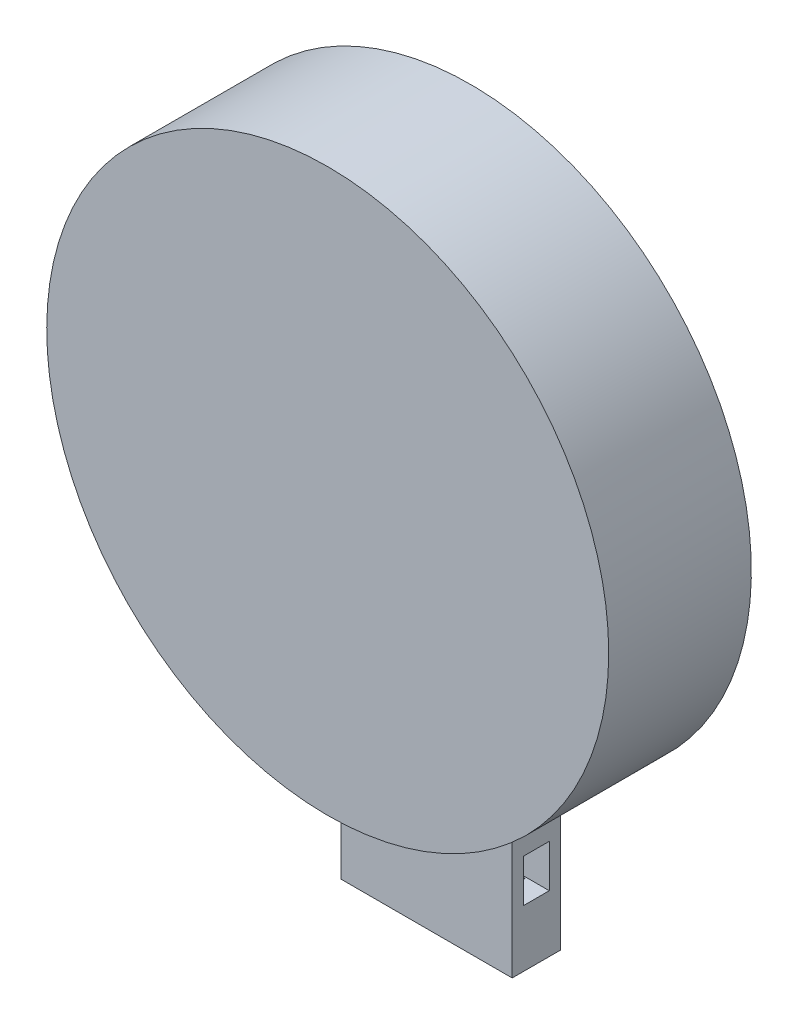
ISO-10303-21;
HEADER;
FILE_DESCRIPTION(('STEP AP214'),'2;1');
FILE_NAME('part.step','',(''),(''),'','','');
FILE_SCHEMA(('AUTOMOTIVE_DESIGN { 1 0 10303 214 1 1 1 1 }'));
ENDSEC;
DATA;
#1=APPLICATION_CONTEXT('core data for automotive mechanical design processes');
#2=APPLICATION_PROTOCOL_DEFINITION('international standard','automotive_design',2000,#1);
#3=PRODUCT_CONTEXT('',#1,'mechanical');
#4=PRODUCT('Part','Part','',(#3));
#5=PRODUCT_RELATED_PRODUCT_CATEGORY('part','',(#4));
#6=PRODUCT_DEFINITION_FORMATION('','',#4);
#7=PRODUCT_DEFINITION_CONTEXT('part definition',#1,'design');
#8=PRODUCT_DEFINITION('design','',#6,#7);
#9=PRODUCT_DEFINITION_SHAPE('','',#8);
#10=(LENGTH_UNIT() NAMED_UNIT(*) SI_UNIT(.MILLI.,.METRE.));
#11=(NAMED_UNIT(*) PLANE_ANGLE_UNIT() SI_UNIT($,.RADIAN.));
#12=(NAMED_UNIT(*) SI_UNIT($,.STERADIAN.) SOLID_ANGLE_UNIT());
#13=UNCERTAINTY_MEASURE_WITH_UNIT(LENGTH_MEASURE(1.E-05),#10,'distance_accuracy_value','');
#14=(GEOMETRIC_REPRESENTATION_CONTEXT(3) GLOBAL_UNCERTAINTY_ASSIGNED_CONTEXT((#13)) GLOBAL_UNIT_ASSIGNED_CONTEXT((#10,
#11,#12)) REPRESENTATION_CONTEXT('',''));
#15=CARTESIAN_POINT('',(0.,0.,0.));
#16=DIRECTION('',(0.,0.,1.));
#17=DIRECTION('',(1.,0.,0.));
#18=AXIS2_PLACEMENT_3D('',#15,#16,#17);
#19=CARTESIAN_POINT('',(0.,0.,50.));
#20=DIRECTION('',(0.,0.,-1.));
#21=DIRECTION('',(-1.,0.,0.));
#22=AXIS2_PLACEMENT_3D('',#19,#20,#21);
#23=CYLINDRICAL_SURFACE('',#22,98.5054101986852);
#24=CARTESIAN_POINT('',(0.,0.,50.));
#25=DIRECTION('',(0.,0.,1.));
#26=DIRECTION('',(1.,0.,0.));
#27=AXIS2_PLACEMENT_3D('',#24,#25,#26);
#28=CIRCLE('',#27,98.5054101986852);
#29=CARTESIAN_POINT('',(98.5054101986852,0.,50.));
#30=VERTEX_POINT('',#29);
#31=EDGE_CURVE('E311',#30,#30,#28,.T.);
#32=ORIENTED_EDGE('',*,*,#31,.F.);
#33=EDGE_LOOP('',(#32));
#34=FACE_BOUND('',#33,.T.);
#35=DIRECTION('',(0.,0.,-1.));
#36=VECTOR('',#35,1.);
#37=CARTESIAN_POINT('',(-28.3340349649579,-94.3424522737021,50.));
#38=LINE('',#37,#36);
#39=CARTESIAN_POINT('',(-28.3340349649579,-94.3424522737022,17.));
#40=VERTEX_POINT('',#39);
#41=CARTESIAN_POINT('',(-28.3340349649579,-94.3424522737022,0.));
#42=VERTEX_POINT('',#41);
#43=EDGE_CURVE('E254',#40,#42,#38,.T.);
#44=ORIENTED_EDGE('',*,*,#43,.F.);
#45=CARTESIAN_POINT('',(0.,0.,17.));
#46=DIRECTION('',(0.,0.,1.));
#47=DIRECTION('',(1.,0.,0.));
#48=AXIS2_PLACEMENT_3D('',#45,#46,#47);
#49=CIRCLE('',#48,98.5054101986852);
#50=CARTESIAN_POINT('',(31.6659650350421,-93.2769129892854,17.));
#51=VERTEX_POINT('',#50);
#52=EDGE_CURVE('E274',#51,#40,#49,.F.);
#53=ORIENTED_EDGE('',*,*,#52,.F.);
#54=DIRECTION('',(0.,0.,-1.));
#55=VECTOR('',#54,1.);
#56=CARTESIAN_POINT('',(31.6659650350421,-93.2769129892854,50.));
#57=LINE('',#56,#55);
#58=CARTESIAN_POINT('',(31.6659650350421,-93.2769129892854,0.));
#59=VERTEX_POINT('',#58);
#60=EDGE_CURVE('E273',#59,#51,#57,.F.);
#61=ORIENTED_EDGE('',*,*,#60,.F.);
#62=CARTESIAN_POINT('',(0.,0.,0.));
#63=DIRECTION('',(0.,0.,1.));
#64=DIRECTION('',(1.,0.,0.));
#65=AXIS2_PLACEMENT_3D('',#62,#63,#64);
#66=CIRCLE('',#65,98.5054101986852);
#67=EDGE_CURVE('E310',#59,#42,#66,.T.);
#68=ORIENTED_EDGE('',*,*,#67,.T.);
#69=EDGE_LOOP('',(#44,#53,#61,#68));
#70=FACE_BOUND('',#69,.T.);
#71=ADVANCED_FACE('F39',(#34,#70),#23,.T.);
#72=CARTESIAN_POINT('',(0.,0.,50.));
#73=DIRECTION('',(0.,0.,1.));
#74=DIRECTION('',(1.,0.,0.));
#75=AXIS2_PLACEMENT_3D('',#72,#73,#74);
#76=PLANE('',#75);
#77=ORIENTED_EDGE('',*,*,#31,.T.);
#78=EDGE_LOOP('',(#77));
#79=FACE_BOUND('',#78,.T.);
#80=ADVANCED_FACE('F345',(#79),#76,.T.);
#81=CARTESIAN_POINT('',(0.,0.,0.));
#82=DIRECTION('',(0.,0.,1.));
#83=DIRECTION('',(1.,0.,0.));
#84=AXIS2_PLACEMENT_3D('',#81,#82,#83);
#85=PLANE('',#84);
#86=ORIENTED_EDGE('',*,*,#67,.F.);
#87=DIRECTION('',(0.,1.,0.));
#88=VECTOR('',#87,1.);
#89=CARTESIAN_POINT('',(31.6659650350421,-148.505410198685,0.));
#90=LINE('',#89,#88);
#91=CARTESIAN_POINT('',(31.6659650350421,-148.505410198685,0.));
#92=VERTEX_POINT('',#91);
#93=EDGE_CURVE('E302',#92,#59,#90,.T.);
#94=ORIENTED_EDGE('',*,*,#93,.F.);
#95=DIRECTION('',(1.,0.,0.));
#96=VECTOR('',#95,1.);
#97=CARTESIAN_POINT('',(31.6659650350421,-148.505410198685,0.));
#98=LINE('',#97,#96);
#99=CARTESIAN_POINT('',(-28.3340349649579,-148.505410198685,0.));
#100=VERTEX_POINT('',#99);
#101=EDGE_CURVE('E285',#100,#92,#98,.T.);
#102=ORIENTED_EDGE('',*,*,#101,.F.);
#103=DIRECTION('',(0.,1.,0.));
#104=VECTOR('',#103,1.);
#105=CARTESIAN_POINT('',(-28.3340349649579,-148.505410198685,0.));
#106=LINE('',#105,#104);
#107=EDGE_CURVE('E306',#100,#42,#106,.T.);
#108=ORIENTED_EDGE('',*,*,#107,.T.);
#109=EDGE_LOOP('',(#86,#94,#102,#108));
#110=FACE_BOUND('',#109,.T.);
#111=ADVANCED_FACE('F350',(#110),#85,.F.);
#112=CARTESIAN_POINT('',(-28.3340349649579,-148.505410198685,17.));
#113=DIRECTION('',(1.,0.,0.));
#114=DIRECTION('',(0.,0.,-1.));
#115=AXIS2_PLACEMENT_3D('',#112,#113,#114);
#116=PLANE('',#115);
#117=DIRECTION('',(0.,0.,1.));
#118=VECTOR('',#117,1.);
#119=CARTESIAN_POINT('',(-28.3340349649579,-128.505410198685,4.));
#120=LINE('',#119,#118);
#121=CARTESIAN_POINT('',(-28.3340349649579,-128.505410198685,4.));
#122=VERTEX_POINT('',#121);
#123=CARTESIAN_POINT('',(-28.3340349649579,-128.505410198685,13.));
#124=VERTEX_POINT('',#123);
#125=EDGE_CURVE('E164',#122,#124,#120,.T.);
#126=ORIENTED_EDGE('',*,*,#125,.F.);
#127=DIRECTION('',(0.,-1.,0.));
#128=VECTOR('',#127,1.);
#129=CARTESIAN_POINT('',(-28.3340349649579,-113.505410198685,4.));
#130=LINE('',#129,#128);
#131=CARTESIAN_POINT('',(-28.3340349649579,-113.505410198685,4.));
#132=VERTEX_POINT('',#131);
#133=EDGE_CURVE('E54',#132,#122,#130,.T.);
#134=ORIENTED_EDGE('',*,*,#133,.F.);
#135=DIRECTION('',(0.,0.,-1.));
#136=VECTOR('',#135,1.);
#137=CARTESIAN_POINT('',(-28.3340349649579,-113.505410198685,4.));
#138=LINE('',#137,#136);
#139=CARTESIAN_POINT('',(-28.3340349649579,-113.505410198685,13.));
#140=VERTEX_POINT('',#139);
#141=EDGE_CURVE('E172',#140,#132,#138,.T.);
#142=ORIENTED_EDGE('',*,*,#141,.F.);
#143=DIRECTION('',(0.,1.,0.));
#144=VECTOR('',#143,1.);
#145=CARTESIAN_POINT('',(-28.3340349649579,-113.505410198685,13.));
#146=LINE('',#145,#144);
#147=EDGE_CURVE('E155',#124,#140,#146,.T.);
#148=ORIENTED_EDGE('',*,*,#147,.F.);
#149=EDGE_LOOP('',(#126,#134,#142,#148));
#150=FACE_BOUND('',#149,.T.);
#151=DIRECTION('',(0.,1.,0.));
#152=VECTOR('',#151,1.);
#153=CARTESIAN_POINT('',(-28.3340349649579,-148.505410198685,17.));
#154=LINE('',#153,#152);
#155=CARTESIAN_POINT('',(-28.3340349649579,-148.505410198685,17.));
#156=VERTEX_POINT('',#155);
#157=EDGE_CURVE('E294',#156,#40,#154,.T.);
#158=ORIENTED_EDGE('',*,*,#157,.T.);
#159=ORIENTED_EDGE('',*,*,#43,.T.);
#160=ORIENTED_EDGE('',*,*,#107,.F.);
#161=DIRECTION('',(0.,0.,-1.));
#162=VECTOR('',#161,1.);
#163=CARTESIAN_POINT('',(-28.3340349649579,-148.505410198685,17.));
#164=LINE('',#163,#162);
#165=EDGE_CURVE('E278',#156,#100,#164,.T.);
#166=ORIENTED_EDGE('',*,*,#165,.F.);
#167=EDGE_LOOP('',(#158,#159,#160,#166));
#168=FACE_BOUND('',#167,.T.);
#169=ADVANCED_FACE('F169',(#150,#168),#116,.F.);
#170=CARTESIAN_POINT('',(31.6659650350421,-148.505410198685,17.));
#171=DIRECTION('',(-1.,0.,0.));
#172=DIRECTION('',(0.,0.,1.));
#173=AXIS2_PLACEMENT_3D('',#170,#171,#172);
#174=PLANE('',#173);
#175=DIRECTION('',(0.,0.,-1.));
#176=VECTOR('',#175,1.);
#177=CARTESIAN_POINT('',(31.6659650350421,-113.505410198685,16.9999999999999));
#178=LINE('',#177,#176);
#179=CARTESIAN_POINT('',(31.6659650350421,-113.505410198685,13.));
#180=VERTEX_POINT('',#179);
#181=CARTESIAN_POINT('',(31.6659650350421,-113.505410198685,4.));
#182=VERTEX_POINT('',#181);
#183=EDGE_CURVE('E213',#180,#182,#178,.T.);
#184=ORIENTED_EDGE('',*,*,#183,.T.);
#185=DIRECTION('',(0.,-1.,0.));
#186=VECTOR('',#185,1.);
#187=CARTESIAN_POINT('',(31.6659650350421,-148.505410198685,4.));
#188=LINE('',#187,#186);
#189=CARTESIAN_POINT('',(31.6659650350421,-128.505410198685,4.));
#190=VERTEX_POINT('',#189);
#191=EDGE_CURVE('E11',#182,#190,#188,.T.);
#192=ORIENTED_EDGE('',*,*,#191,.T.);
#193=DIRECTION('',(0.,0.,1.));
#194=VECTOR('',#193,1.);
#195=CARTESIAN_POINT('',(31.6659650350421,-128.505410198685,17.));
#196=LINE('',#195,#194);
#197=CARTESIAN_POINT('',(31.6659650350421,-128.505410198685,13.));
#198=VERTEX_POINT('',#197);
#199=EDGE_CURVE('E198',#190,#198,#196,.T.);
#200=ORIENTED_EDGE('',*,*,#199,.T.);
#201=DIRECTION('',(0.,1.,0.));
#202=VECTOR('',#201,1.);
#203=CARTESIAN_POINT('',(31.6659650350421,-148.505410198685,13.));
#204=LINE('',#203,#202);
#205=EDGE_CURVE('E47',#198,#180,#204,.T.);
#206=ORIENTED_EDGE('',*,*,#205,.T.);
#207=EDGE_LOOP('',(#184,#192,#200,#206));
#208=FACE_BOUND('',#207,.T.);
#209=ORIENTED_EDGE('',*,*,#93,.T.);
#210=ORIENTED_EDGE('',*,*,#60,.T.);
#211=DIRECTION('',(0.,1.,0.));
#212=VECTOR('',#211,1.);
#213=CARTESIAN_POINT('',(31.6659650350421,-148.505410198685,17.));
#214=LINE('',#213,#212);
#215=CARTESIAN_POINT('',(31.6659650350421,-148.505410198685,17.));
#216=VERTEX_POINT('',#215);
#217=EDGE_CURVE('E298',#216,#51,#214,.T.);
#218=ORIENTED_EDGE('',*,*,#217,.F.);
#219=DIRECTION('',(0.,0.,1.));
#220=VECTOR('',#219,1.);
#221=CARTESIAN_POINT('',(31.6659650350421,-148.505410198685,17.));
#222=LINE('',#221,#220);
#223=EDGE_CURVE('E288',#92,#216,#222,.T.);
#224=ORIENTED_EDGE('',*,*,#223,.F.);
#225=EDGE_LOOP('',(#209,#210,#218,#224));
#226=FACE_BOUND('',#225,.T.);
#227=ADVANCED_FACE('F326',(#208,#226),#174,.F.);
#228=CARTESIAN_POINT('',(31.6659650350421,-148.505410198685,17.));
#229=DIRECTION('',(0.,0.,-1.));
#230=DIRECTION('',(-1.,0.,0.));
#231=AXIS2_PLACEMENT_3D('',#228,#229,#230);
#232=PLANE('',#231);
#233=ORIENTED_EDGE('',*,*,#217,.T.);
#234=ORIENTED_EDGE('',*,*,#52,.T.);
#235=ORIENTED_EDGE('',*,*,#157,.F.);
#236=DIRECTION('',(-1.,0.,0.));
#237=VECTOR('',#236,1.);
#238=CARTESIAN_POINT('',(31.6659650350421,-148.505410198685,17.));
#239=LINE('',#238,#237);
#240=EDGE_CURVE('E291',#216,#156,#239,.T.);
#241=ORIENTED_EDGE('',*,*,#240,.F.);
#242=EDGE_LOOP('',(#233,#234,#235,#241));
#243=FACE_BOUND('',#242,.T.);
#244=ADVANCED_FACE('F361',(#243),#232,.F.);
#245=CARTESIAN_POINT('',(0.,-148.505410198685,0.));
#246=DIRECTION('',(0.,1.,0.));
#247=DIRECTION('',(0.,0.,1.));
#248=AXIS2_PLACEMENT_3D('',#245,#246,#247);
#249=PLANE('',#248);
#250=DIRECTION('',(1.,0.,0.));
#251=VECTOR('',#250,1.);
#252=CARTESIAN_POINT('',(23.6659650350421,-148.505410198685,4.5));
#253=LINE('',#252,#251);
#254=CARTESIAN_POINT('',(-20.3340349649579,-148.505410198685,4.49999999999999));
#255=VERTEX_POINT('',#254);
#256=CARTESIAN_POINT('',(23.6659650350421,-148.505410198685,4.5));
#257=VERTEX_POINT('',#256);
#258=EDGE_CURVE('E239',#255,#257,#253,.T.);
#259=ORIENTED_EDGE('',*,*,#258,.F.);
#260=DIRECTION('',(0.,0.,-1.));
#261=VECTOR('',#260,1.);
#262=CARTESIAN_POINT('',(-20.3340349649579,-148.505410198685,4.49999999999999));
#263=LINE('',#262,#261);
#264=CARTESIAN_POINT('',(-20.3340349649579,-148.505410198685,12.5));
#265=VERTEX_POINT('',#264);
#266=EDGE_CURVE('E217',#265,#255,#263,.T.);
#267=ORIENTED_EDGE('',*,*,#266,.F.);
#268=DIRECTION('',(-1.,0.,0.));
#269=VECTOR('',#268,1.);
#270=CARTESIAN_POINT('',(23.6659650350421,-148.505410198685,12.5));
#271=LINE('',#270,#269);
#272=CARTESIAN_POINT('',(23.6659650350421,-148.505410198685,12.5));
#273=VERTEX_POINT('',#272);
#274=EDGE_CURVE('E223',#273,#265,#271,.T.);
#275=ORIENTED_EDGE('',*,*,#274,.F.);
#276=DIRECTION('',(0.,0.,1.));
#277=VECTOR('',#276,1.);
#278=CARTESIAN_POINT('',(23.6659650350421,-148.505410198685,4.5));
#279=LINE('',#278,#277);
#280=EDGE_CURVE('E243',#257,#273,#279,.T.);
#281=ORIENTED_EDGE('',*,*,#280,.F.);
#282=EDGE_LOOP('',(#259,#267,#275,#281));
#283=FACE_BOUND('',#282,.T.);
#284=ORIENTED_EDGE('',*,*,#165,.T.);
#285=ORIENTED_EDGE('',*,*,#101,.T.);
#286=ORIENTED_EDGE('',*,*,#223,.T.);
#287=ORIENTED_EDGE('',*,*,#240,.T.);
#288=EDGE_LOOP('',(#284,#285,#286,#287));
#289=FACE_BOUND('',#288,.T.);
#290=ADVANCED_FACE('F367',(#283,#289),#249,.F.);
#291=CARTESIAN_POINT('',(-20.3340349649579,-108.505410198685,4.49999999999999));
#292=DIRECTION('',(-1.,0.,0.));
#293=DIRECTION('',(0.,0.,1.));
#294=AXIS2_PLACEMENT_3D('',#291,#292,#293);
#295=PLANE('',#294);
#296=DIRECTION('',(0.,-1.,0.));
#297=VECTOR('',#296,1.);
#298=CARTESIAN_POINT('',(-20.3340349649579,-108.505410198685,4.49999999999999));
#299=LINE('',#298,#297);
#300=CARTESIAN_POINT('',(-20.3340349649579,-128.505410198685,4.49999999999999));
#301=VERTEX_POINT('',#300);
#302=EDGE_CURVE('E235',#301,#255,#299,.T.);
#303=ORIENTED_EDGE('',*,*,#302,.F.);
#304=DIRECTION('',(0.,0.,1.));
#305=VECTOR('',#304,1.);
#306=CARTESIAN_POINT('',(-20.3340349649579,-128.505410198685,4.49999999999999));
#307=LINE('',#306,#305);
#308=CARTESIAN_POINT('',(-20.3340349649579,-128.505410198685,12.5));
#309=VERTEX_POINT('',#308);
#310=EDGE_CURVE('E194',#301,#309,#307,.T.);
#311=ORIENTED_EDGE('',*,*,#310,.T.);
#312=DIRECTION('',(0.,-1.,0.));
#313=VECTOR('',#312,1.);
#314=CARTESIAN_POINT('',(-20.3340349649579,-108.505410198685,12.5));
#315=LINE('',#314,#313);
#316=EDGE_CURVE('E255',#309,#265,#315,.T.);
#317=ORIENTED_EDGE('',*,*,#316,.T.);
#318=ORIENTED_EDGE('',*,*,#266,.T.);
#319=EDGE_LOOP('',(#303,#311,#317,#318));
#320=FACE_BOUND('',#319,.T.);
#321=ADVANCED_FACE('F369',(#320),#295,.F.);
#322=CARTESIAN_POINT('',(23.6659650350421,-108.505410198685,12.5));
#323=DIRECTION('',(0.,0.,1.));
#324=DIRECTION('',(1.,0.,0.));
#325=AXIS2_PLACEMENT_3D('',#322,#323,#324);
#326=PLANE('',#325);
#327=ORIENTED_EDGE('',*,*,#316,.F.);
#328=DIRECTION('',(1.,0.,0.));
#329=VECTOR('',#328,1.);
#330=CARTESIAN_POINT('',(23.6659650350421,-128.505410198685,12.5));
#331=LINE('',#330,#329);
#332=CARTESIAN_POINT('',(23.6659650350421,-128.505410198685,12.5));
#333=VERTEX_POINT('',#332);
#334=EDGE_CURVE('E190',#309,#333,#331,.T.);
#335=ORIENTED_EDGE('',*,*,#334,.T.);
#336=DIRECTION('',(0.,-1.,0.));
#337=VECTOR('',#336,1.);
#338=CARTESIAN_POINT('',(23.6659650350421,-108.505410198685,12.5));
#339=LINE('',#338,#337);
#340=EDGE_CURVE('E260',#333,#273,#339,.T.);
#341=ORIENTED_EDGE('',*,*,#340,.T.);
#342=ORIENTED_EDGE('',*,*,#274,.T.);
#343=EDGE_LOOP('',(#327,#335,#341,#342));
#344=FACE_BOUND('',#343,.T.);
#345=ADVANCED_FACE('F376',(#344),#326,.F.);
#346=CARTESIAN_POINT('',(23.6659650350421,-108.505410198685,4.5));
#347=DIRECTION('',(1.,0.,0.));
#348=DIRECTION('',(0.,0.,-1.));
#349=AXIS2_PLACEMENT_3D('',#346,#347,#348);
#350=PLANE('',#349);
#351=ORIENTED_EDGE('',*,*,#340,.F.);
#352=DIRECTION('',(0.,0.,-1.));
#353=VECTOR('',#352,1.);
#354=CARTESIAN_POINT('',(23.6659650350421,-128.505410198685,4.5));
#355=LINE('',#354,#353);
#356=CARTESIAN_POINT('',(23.6659650350421,-128.505410198685,4.5));
#357=VERTEX_POINT('',#356);
#358=EDGE_CURVE('E182',#333,#357,#355,.T.);
#359=ORIENTED_EDGE('',*,*,#358,.T.);
#360=DIRECTION('',(0.,-1.,0.));
#361=VECTOR('',#360,1.);
#362=CARTESIAN_POINT('',(23.6659650350421,-108.505410198685,4.5));
#363=LINE('',#362,#361);
#364=EDGE_CURVE('E265',#357,#257,#363,.T.);
#365=ORIENTED_EDGE('',*,*,#364,.T.);
#366=ORIENTED_EDGE('',*,*,#280,.T.);
#367=EDGE_LOOP('',(#351,#359,#365,#366));
#368=FACE_BOUND('',#367,.T.);
#369=ADVANCED_FACE('F442',(#368),#350,.F.);
#370=CARTESIAN_POINT('',(23.6659650350421,-108.505410198685,4.5));
#371=DIRECTION('',(0.,0.,-1.));
#372=DIRECTION('',(-1.,0.,0.));
#373=AXIS2_PLACEMENT_3D('',#370,#371,#372);
#374=PLANE('',#373);
#375=ORIENTED_EDGE('',*,*,#364,.F.);
#376=DIRECTION('',(-1.,0.,0.));
#377=VECTOR('',#376,1.);
#378=CARTESIAN_POINT('',(23.6659650350421,-128.505410198685,4.5));
#379=LINE('',#378,#377);
#380=EDGE_CURVE('E315',#357,#301,#379,.T.);
#381=ORIENTED_EDGE('',*,*,#380,.T.);
#382=ORIENTED_EDGE('',*,*,#302,.T.);
#383=ORIENTED_EDGE('',*,*,#258,.T.);
#384=EDGE_LOOP('',(#375,#381,#382,#383));
#385=FACE_BOUND('',#384,.T.);
#386=ADVANCED_FACE('F434',(#385),#374,.F.);
#387=CARTESIAN_POINT('',(98.5054101986852,-113.505410198685,4.));
#388=DIRECTION('',(0.,0.,-1.));
#389=DIRECTION('',(0.,1.,0.));
#390=AXIS2_PLACEMENT_3D('',#387,#388,#389);
#391=PLANE('',#390);
#392=DIRECTION('',(-1.,0.,0.));
#393=VECTOR('',#392,1.);
#394=CARTESIAN_POINT('',(98.5054101986852,-113.505410198685,4.));
#395=LINE('',#394,#393);
#396=EDGE_CURVE('E179',#182,#132,#395,.T.);
#397=ORIENTED_EDGE('',*,*,#396,.T.);
#398=ORIENTED_EDGE('',*,*,#133,.T.);
#399=DIRECTION('',(-1.,0.,0.));
#400=VECTOR('',#399,1.);
#401=CARTESIAN_POINT('',(98.5054101986852,-128.505410198685,4.));
#402=LINE('',#401,#400);
#403=EDGE_CURVE('E161',#190,#122,#402,.T.);
#404=ORIENTED_EDGE('',*,*,#403,.F.);
#405=ORIENTED_EDGE('',*,*,#191,.F.);
#406=EDGE_LOOP('',(#397,#398,#404,#405));
#407=FACE_BOUND('',#406,.T.);
#408=ADVANCED_FACE('F328',(#407),#391,.F.);
#409=CARTESIAN_POINT('',(98.5054101986852,-113.505410198685,13.));
#410=DIRECTION('',(0.,0.,1.));
#411=DIRECTION('',(1.,0.,0.));
#412=AXIS2_PLACEMENT_3D('',#409,#410,#411);
#413=PLANE('',#412);
#414=DIRECTION('',(-1.,0.,0.));
#415=VECTOR('',#414,1.);
#416=CARTESIAN_POINT('',(98.5054101986852,-128.505410198685,13.));
#417=LINE('',#416,#415);
#418=EDGE_CURVE('E62',#198,#124,#417,.T.);
#419=ORIENTED_EDGE('',*,*,#418,.T.);
#420=ORIENTED_EDGE('',*,*,#147,.T.);
#421=DIRECTION('',(-1.,0.,0.));
#422=VECTOR('',#421,1.);
#423=CARTESIAN_POINT('',(98.5054101986852,-113.505410198685,13.));
#424=LINE('',#423,#422);
#425=EDGE_CURVE('E160',#180,#140,#424,.T.);
#426=ORIENTED_EDGE('',*,*,#425,.F.);
#427=ORIENTED_EDGE('',*,*,#205,.F.);
#428=EDGE_LOOP('',(#419,#420,#426,#427));
#429=FACE_BOUND('',#428,.T.);
#430=ADVANCED_FACE('F152',(#429),#413,.F.);
#431=CARTESIAN_POINT('',(98.5054101986852,-113.505410198685,4.));
#432=DIRECTION('',(0.,1.,0.));
#433=DIRECTION('',(0.,0.,1.));
#434=AXIS2_PLACEMENT_3D('',#431,#432,#433);
#435=PLANE('',#434);
#436=DIRECTION('',(-1.,0.,0.));
#437=VECTOR('',#436,1.);
#438=CARTESIAN_POINT('',(23.6659650350421,-113.505410198685,12.5));
#439=LINE('',#438,#437);
#440=CARTESIAN_POINT('',(23.6659650350421,-113.505410198685,12.5));
#441=VERTEX_POINT('',#440);
#442=CARTESIAN_POINT('',(-20.3340349649579,-113.505410198685,12.5));
#443=VERTEX_POINT('',#442);
#444=EDGE_CURVE('E205',#441,#443,#439,.T.);
#445=ORIENTED_EDGE('',*,*,#444,.F.);
#446=DIRECTION('',(0.,0.,1.));
#447=VECTOR('',#446,1.);
#448=CARTESIAN_POINT('',(23.6659650350421,-113.505410198685,4.50000000000001));
#449=LINE('',#448,#447);
#450=CARTESIAN_POINT('',(23.6659650350421,-113.505410198685,4.5));
#451=VERTEX_POINT('',#450);
#452=EDGE_CURVE('E201',#451,#441,#449,.T.);
#453=ORIENTED_EDGE('',*,*,#452,.F.);
#454=DIRECTION('',(1.,0.,0.));
#455=VECTOR('',#454,1.);
#456=CARTESIAN_POINT('',(23.6659650350421,-113.505410198685,4.5));
#457=LINE('',#456,#455);
#458=CARTESIAN_POINT('',(-20.3340349649579,-113.505410198685,4.49999999999999));
#459=VERTEX_POINT('',#458);
#460=EDGE_CURVE('E321',#459,#451,#457,.T.);
#461=ORIENTED_EDGE('',*,*,#460,.F.);
#462=DIRECTION('',(0.,0.,-1.));
#463=VECTOR('',#462,1.);
#464=CARTESIAN_POINT('',(-20.3340349649579,-113.505410198685,4.5));
#465=LINE('',#464,#463);
#466=EDGE_CURVE('E209',#443,#459,#465,.T.);
#467=ORIENTED_EDGE('',*,*,#466,.F.);
#468=EDGE_LOOP('',(#445,#453,#461,#467));
#469=FACE_BOUND('',#468,.T.);
#470=ORIENTED_EDGE('',*,*,#425,.T.);
#471=ORIENTED_EDGE('',*,*,#141,.T.);
#472=ORIENTED_EDGE('',*,*,#396,.F.);
#473=ORIENTED_EDGE('',*,*,#183,.F.);
#474=EDGE_LOOP('',(#470,#471,#472,#473));
#475=FACE_BOUND('',#474,.T.);
#476=ADVANCED_FACE('F331',(#469,#475),#435,.F.);
#477=CARTESIAN_POINT('',(98.5054101986852,-128.505410198685,4.));
#478=DIRECTION('',(0.,-1.,0.));
#479=DIRECTION('',(0.,0.,-1.));
#480=AXIS2_PLACEMENT_3D('',#477,#478,#479);
#481=PLANE('',#480);
#482=ORIENTED_EDGE('',*,*,#380,.F.);
#483=ORIENTED_EDGE('',*,*,#358,.F.);
#484=ORIENTED_EDGE('',*,*,#334,.F.);
#485=ORIENTED_EDGE('',*,*,#310,.F.);
#486=EDGE_LOOP('',(#482,#483,#484,#485));
#487=FACE_BOUND('',#486,.T.);
#488=ORIENTED_EDGE('',*,*,#403,.T.);
#489=ORIENTED_EDGE('',*,*,#125,.T.);
#490=ORIENTED_EDGE('',*,*,#418,.F.);
#491=ORIENTED_EDGE('',*,*,#199,.F.);
#492=EDGE_LOOP('',(#488,#489,#490,#491));
#493=FACE_BOUND('',#492,.T.);
#494=ADVANCED_FACE('F165',(#487,#493),#481,.F.);
#495=CARTESIAN_POINT('',(0.,-108.505410198685,0.));
#496=DIRECTION('',(0.,-1.,0.));
#497=DIRECTION('',(0.,0.,-1.));
#498=AXIS2_PLACEMENT_3D('',#495,#496,#497);
#499=PLANE('',#498);
#500=DIRECTION('',(0.,0.,-1.));
#501=VECTOR('',#500,1.);
#502=CARTESIAN_POINT('',(-20.3340349649579,-108.505410198685,4.49999999999999));
#503=LINE('',#502,#501);
#504=CARTESIAN_POINT('',(-20.3340349649579,-108.505410198685,12.5));
#505=VERTEX_POINT('',#504);
#506=CARTESIAN_POINT('',(-20.3340349649579,-108.505410198685,4.49999999999999));
#507=VERTEX_POINT('',#506);
#508=EDGE_CURVE('E218',#505,#507,#503,.T.);
#509=ORIENTED_EDGE('',*,*,#508,.T.);
#510=DIRECTION('',(1.,0.,0.));
#511=VECTOR('',#510,1.);
#512=CARTESIAN_POINT('',(23.6659650350421,-108.505410198685,4.5));
#513=LINE('',#512,#511);
#514=CARTESIAN_POINT('',(23.6659650350421,-108.505410198685,4.5));
#515=VERTEX_POINT('',#514);
#516=EDGE_CURVE('E222',#507,#515,#513,.T.);
#517=ORIENTED_EDGE('',*,*,#516,.T.);
#518=DIRECTION('',(0.,0.,1.));
#519=VECTOR('',#518,1.);
#520=CARTESIAN_POINT('',(23.6659650350421,-108.505410198685,4.5));
#521=LINE('',#520,#519);
#522=CARTESIAN_POINT('',(23.6659650350421,-108.505410198685,12.5));
#523=VERTEX_POINT('',#522);
#524=EDGE_CURVE('E227',#515,#523,#521,.T.);
#525=ORIENTED_EDGE('',*,*,#524,.T.);
#526=DIRECTION('',(-1.,0.,0.));
#527=VECTOR('',#526,1.);
#528=CARTESIAN_POINT('',(23.6659650350421,-108.505410198685,12.5));
#529=LINE('',#528,#527);
#530=EDGE_CURVE('E231',#523,#505,#529,.T.);
#531=ORIENTED_EDGE('',*,*,#530,.T.);
#532=EDGE_LOOP('',(#509,#517,#525,#531));
#533=FACE_BOUND('',#532,.T.);
#534=ADVANCED_FACE('F340',(#533),#499,.T.);
#535=EDGE_CURVE('E266',#507,#459,#299,.T.);
#536=ORIENTED_EDGE('',*,*,#535,.T.);
#537=ORIENTED_EDGE('',*,*,#460,.T.);
#538=EDGE_CURVE('E261',#515,#451,#363,.T.);
#539=ORIENTED_EDGE('',*,*,#538,.F.);
#540=ORIENTED_EDGE('',*,*,#516,.F.);
#541=EDGE_LOOP('',(#536,#537,#539,#540));
#542=FACE_BOUND('',#541,.T.);
#543=ADVANCED_FACE('F418',(#542),#374,.F.);
#544=ORIENTED_EDGE('',*,*,#538,.T.);
#545=ORIENTED_EDGE('',*,*,#452,.T.);
#546=EDGE_CURVE('E256',#523,#441,#339,.T.);
#547=ORIENTED_EDGE('',*,*,#546,.F.);
#548=ORIENTED_EDGE('',*,*,#524,.F.);
#549=EDGE_LOOP('',(#544,#545,#547,#548));
#550=FACE_BOUND('',#549,.T.);
#551=ADVANCED_FACE('F432',(#550),#350,.F.);
#552=ORIENTED_EDGE('',*,*,#546,.T.);
#553=ORIENTED_EDGE('',*,*,#444,.T.);
#554=EDGE_CURVE('E250',#505,#443,#315,.T.);
#555=ORIENTED_EDGE('',*,*,#554,.F.);
#556=ORIENTED_EDGE('',*,*,#530,.F.);
#557=EDGE_LOOP('',(#552,#553,#555,#556));
#558=FACE_BOUND('',#557,.T.);
#559=ADVANCED_FACE('F439',(#558),#326,.F.);
#560=ORIENTED_EDGE('',*,*,#554,.T.);
#561=ORIENTED_EDGE('',*,*,#466,.T.);
#562=ORIENTED_EDGE('',*,*,#535,.F.);
#563=ORIENTED_EDGE('',*,*,#508,.F.);
#564=EDGE_LOOP('',(#560,#561,#562,#563));
#565=FACE_BOUND('',#564,.T.);
#566=ADVANCED_FACE('F379',(#565),#295,.F.);
#567=CLOSED_SHELL('',(#71,#80,#111,#169,#227,#244,#290,#321,#345,#369,#386,#408,#430,#476,#494,
#534,#543,#551,#559,#566));
#568=MANIFOLD_SOLID_BREP('B2',#567);
#569=ADVANCED_BREP_SHAPE_REPRESENTATION('',(#18,#568),#14);
#570=SHAPE_DEFINITION_REPRESENTATION(#9,#569);
ENDSEC;
END-ISO-10303-21;
